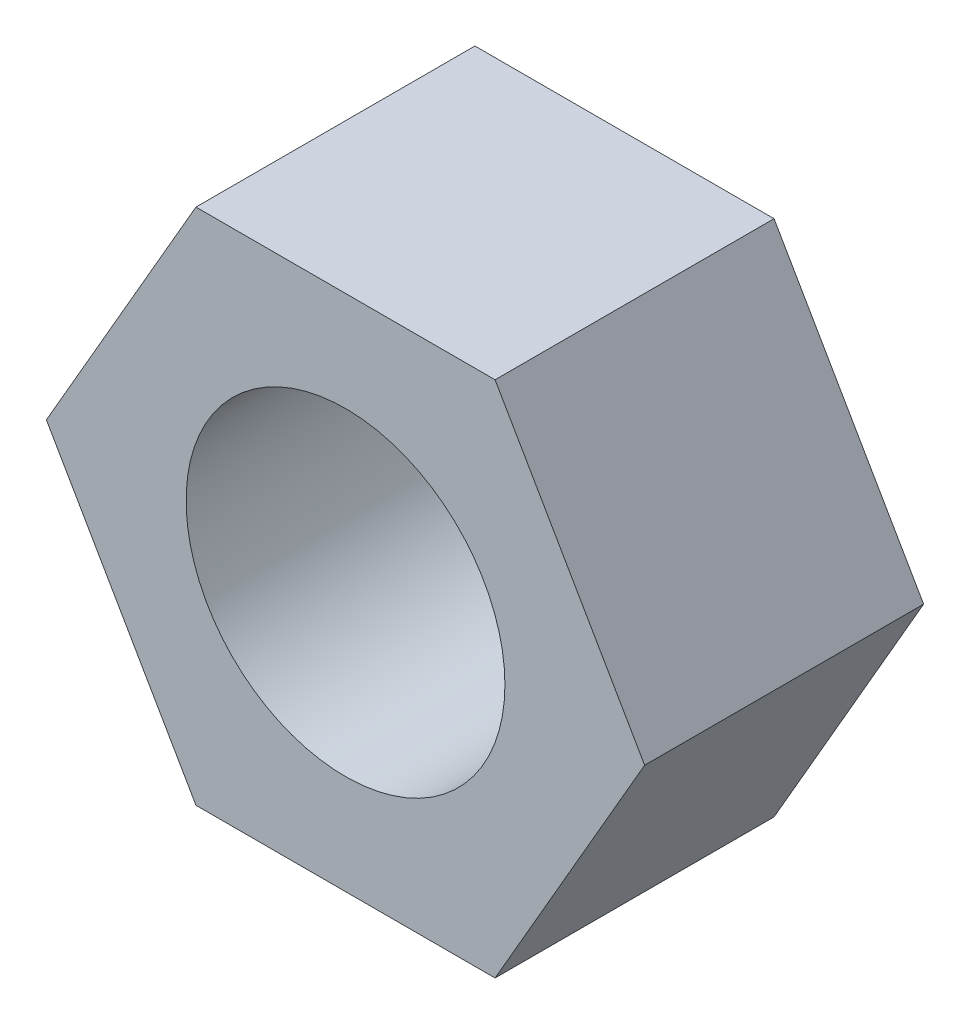
ISO-10303-21;
HEADER;
FILE_DESCRIPTION(('STEP AP214'),'2;1');
FILE_NAME('part.step','',(''),(''),'','','');
FILE_SCHEMA(('AUTOMOTIVE_DESIGN { 1 0 10303 214 1 1 1 1 }'));
ENDSEC;
DATA;
#1=APPLICATION_CONTEXT('core data for automotive mechanical design processes');
#2=APPLICATION_PROTOCOL_DEFINITION('international standard','automotive_design',2000,#1);
#3=PRODUCT_CONTEXT('',#1,'mechanical');
#4=PRODUCT('Part','Part','',(#3));
#5=PRODUCT_RELATED_PRODUCT_CATEGORY('part','',(#4));
#6=PRODUCT_DEFINITION_FORMATION('','',#4);
#7=PRODUCT_DEFINITION_CONTEXT('part definition',#1,'design');
#8=PRODUCT_DEFINITION('design','',#6,#7);
#9=PRODUCT_DEFINITION_SHAPE('','',#8);
#10=(LENGTH_UNIT() NAMED_UNIT(*) SI_UNIT(.MILLI.,.METRE.));
#11=(NAMED_UNIT(*) PLANE_ANGLE_UNIT() SI_UNIT($,.RADIAN.));
#12=(NAMED_UNIT(*) SI_UNIT($,.STERADIAN.) SOLID_ANGLE_UNIT());
#13=UNCERTAINTY_MEASURE_WITH_UNIT(LENGTH_MEASURE(1.E-05),#10,'distance_accuracy_value','');
#14=(GEOMETRIC_REPRESENTATION_CONTEXT(3) GLOBAL_UNCERTAINTY_ASSIGNED_CONTEXT((#13)) GLOBAL_UNIT_ASSIGNED_CONTEXT((#10,
#11,#12)) REPRESENTATION_CONTEXT('',''));
#15=CARTESIAN_POINT('',(0.,0.,0.));
#16=DIRECTION('',(0.,0.,1.));
#17=DIRECTION('',(1.,0.,0.));
#18=AXIS2_PLACEMENT_3D('',#15,#16,#17);
#19=CARTESIAN_POINT('',(3.75277674973263,-6.49999999999993,7.));
#20=DIRECTION('',(-0.866025403784442,0.499999999999995,0.));
#21=DIRECTION('',(-0.499999999999995,-0.866025403784442,0.));
#22=AXIS2_PLACEMENT_3D('',#19,#20,#21);
#23=PLANE('',#22);
#24=DIRECTION('',(0.499999999999995,0.866025403784442,0.));
#25=VECTOR('',#24,1.);
#26=CARTESIAN_POINT('',(3.75277674973263,-6.49999999999993,0.));
#27=LINE('',#26,#25);
#28=CARTESIAN_POINT('',(3.75277674973263,-6.49999999999993,0.));
#29=VERTEX_POINT('',#28);
#30=CARTESIAN_POINT('',(7.50555349946511,0.,0.));
#31=VERTEX_POINT('',#30);
#32=EDGE_CURVE('E123',#29,#31,#27,.T.);
#33=ORIENTED_EDGE('',*,*,#32,.T.);
#34=DIRECTION('',(0.,0.,-1.));
#35=VECTOR('',#34,1.);
#36=CARTESIAN_POINT('',(7.50555349946511,0.,7.));
#37=LINE('',#36,#35);
#38=CARTESIAN_POINT('',(7.50555349946511,0.,7.));
#39=VERTEX_POINT('',#38);
#40=EDGE_CURVE('E11',#39,#31,#37,.T.);
#41=ORIENTED_EDGE('',*,*,#40,.F.);
#42=DIRECTION('',(0.499999999999995,0.866025403784442,0.));
#43=VECTOR('',#42,1.);
#44=CARTESIAN_POINT('',(3.75277674973263,-6.49999999999993,7.));
#45=LINE('',#44,#43);
#46=CARTESIAN_POINT('',(3.75277674973263,-6.49999999999993,7.));
#47=VERTEX_POINT('',#46);
#48=EDGE_CURVE('E134',#47,#39,#45,.T.);
#49=ORIENTED_EDGE('',*,*,#48,.F.);
#50=DIRECTION('',(0.,0.,-1.));
#51=VECTOR('',#50,1.);
#52=CARTESIAN_POINT('',(3.75277674973263,-6.49999999999993,7.));
#53=LINE('',#52,#51);
#54=EDGE_CURVE('E119',#47,#29,#53,.T.);
#55=ORIENTED_EDGE('',*,*,#54,.T.);
#56=EDGE_LOOP('',(#33,#41,#49,#55));
#57=FACE_BOUND('',#56,.T.);
#58=ADVANCED_FACE('F39',(#57),#23,.F.);
#59=CARTESIAN_POINT('',(7.50555349946511,0.,7.));
#60=DIRECTION('',(-0.866025403784438,-0.500000000000001,0.));
#61=DIRECTION('',(0.500000000000001,-0.866025403784438,0.));
#62=AXIS2_PLACEMENT_3D('',#59,#60,#61);
#63=PLANE('',#62);
#64=DIRECTION('',(-0.500000000000001,0.866025403784438,0.));
#65=VECTOR('',#64,1.);
#66=CARTESIAN_POINT('',(7.50555349946511,0.,0.));
#67=LINE('',#66,#65);
#68=CARTESIAN_POINT('',(3.75277674973254,6.49999999999999,0.));
#69=VERTEX_POINT('',#68);
#70=EDGE_CURVE('E126',#31,#69,#67,.T.);
#71=ORIENTED_EDGE('',*,*,#70,.T.);
#72=DIRECTION('',(0.,0.,-1.));
#73=VECTOR('',#72,1.);
#74=CARTESIAN_POINT('',(3.75277674973254,6.49999999999999,7.));
#75=LINE('',#74,#73);
#76=CARTESIAN_POINT('',(3.75277674973254,6.49999999999999,7.));
#77=VERTEX_POINT('',#76);
#78=EDGE_CURVE('E47',#77,#69,#75,.T.);
#79=ORIENTED_EDGE('',*,*,#78,.F.);
#80=DIRECTION('',(-0.500000000000001,0.866025403784438,0.));
#81=VECTOR('',#80,1.);
#82=CARTESIAN_POINT('',(7.50555349946511,0.,7.));
#83=LINE('',#82,#81);
#84=EDGE_CURVE('E92',#39,#77,#83,.T.);
#85=ORIENTED_EDGE('',*,*,#84,.F.);
#86=ORIENTED_EDGE('',*,*,#40,.T.);
#87=EDGE_LOOP('',(#71,#79,#85,#86));
#88=FACE_BOUND('',#87,.T.);
#89=ADVANCED_FACE('F159',(#88),#63,.F.);
#90=CARTESIAN_POINT('',(3.75277674973254,6.49999999999999,7.));
#91=DIRECTION('',(0.,-1.,0.));
#92=DIRECTION('',(1.,0.,0.));
#93=AXIS2_PLACEMENT_3D('',#90,#91,#92);
#94=PLANE('',#93);
#95=DIRECTION('',(-1.,0.,0.));
#96=VECTOR('',#95,1.);
#97=CARTESIAN_POINT('',(3.75277674973254,6.49999999999999,0.));
#98=LINE('',#97,#96);
#99=CARTESIAN_POINT('',(-3.75277674973258,6.49999999999996,0.));
#100=VERTEX_POINT('',#99);
#101=EDGE_CURVE('E129',#69,#100,#98,.T.);
#102=ORIENTED_EDGE('',*,*,#101,.T.);
#103=DIRECTION('',(0.,0.,-1.));
#104=VECTOR('',#103,1.);
#105=CARTESIAN_POINT('',(-3.75277674973258,6.49999999999996,7.));
#106=LINE('',#105,#104);
#107=CARTESIAN_POINT('',(-3.75277674973258,6.49999999999996,7.));
#108=VERTEX_POINT('',#107);
#109=EDGE_CURVE('E114',#108,#100,#106,.T.);
#110=ORIENTED_EDGE('',*,*,#109,.F.);
#111=DIRECTION('',(-1.,0.,0.));
#112=VECTOR('',#111,1.);
#113=CARTESIAN_POINT('',(3.75277674973254,6.49999999999999,7.));
#114=LINE('',#113,#112);
#115=EDGE_CURVE('E105',#77,#108,#114,.T.);
#116=ORIENTED_EDGE('',*,*,#115,.F.);
#117=ORIENTED_EDGE('',*,*,#78,.T.);
#118=EDGE_LOOP('',(#102,#110,#116,#117));
#119=FACE_BOUND('',#118,.T.);
#120=ADVANCED_FACE('F140',(#119),#94,.F.);
#121=CARTESIAN_POINT('',(-3.75277674973258,6.49999999999996,7.));
#122=DIRECTION('',(0.866025403784441,-0.499999999999995,0.));
#123=DIRECTION('',(0.499999999999995,0.866025403784442,0.));
#124=AXIS2_PLACEMENT_3D('',#121,#122,#123);
#125=PLANE('',#124);
#126=DIRECTION('',(-0.499999999999995,-0.866025403784441,0.));
#127=VECTOR('',#126,1.);
#128=CARTESIAN_POINT('',(-3.75277674973258,6.49999999999996,0.));
#129=LINE('',#128,#127);
#130=CARTESIAN_POINT('',(-7.50555349946511,0.,0.));
#131=VERTEX_POINT('',#130);
#132=EDGE_CURVE('E113',#100,#131,#129,.T.);
#133=ORIENTED_EDGE('',*,*,#132,.T.);
#134=DIRECTION('',(0.,0.,-1.));
#135=VECTOR('',#134,1.);
#136=CARTESIAN_POINT('',(-7.50555349946511,0.,7.));
#137=LINE('',#136,#135);
#138=CARTESIAN_POINT('',(-7.50555349946511,0.,7.));
#139=VERTEX_POINT('',#138);
#140=EDGE_CURVE('E110',#139,#131,#137,.T.);
#141=ORIENTED_EDGE('',*,*,#140,.F.);
#142=DIRECTION('',(-0.499999999999995,-0.866025403784441,0.));
#143=VECTOR('',#142,1.);
#144=CARTESIAN_POINT('',(-3.75277674973258,6.49999999999996,7.));
#145=LINE('',#144,#143);
#146=EDGE_CURVE('E99',#108,#139,#145,.T.);
#147=ORIENTED_EDGE('',*,*,#146,.F.);
#148=ORIENTED_EDGE('',*,*,#109,.T.);
#149=EDGE_LOOP('',(#133,#141,#147,#148));
#150=FACE_BOUND('',#149,.T.);
#151=ADVANCED_FACE('F111',(#150),#125,.F.);
#152=CARTESIAN_POINT('',(-7.50555349946511,0.,7.));
#153=DIRECTION('',(0.866025403784435,0.500000000000007,0.));
#154=DIRECTION('',(-0.500000000000007,0.866025403784435,0.));
#155=AXIS2_PLACEMENT_3D('',#152,#153,#154);
#156=PLANE('',#155);
#157=DIRECTION('',(0.500000000000007,-0.866025403784435,0.));
#158=VECTOR('',#157,1.);
#159=CARTESIAN_POINT('',(-7.50555349946511,0.,0.));
#160=LINE('',#159,#158);
#161=CARTESIAN_POINT('',(-3.75277674973249,-6.50000000000001,0.));
#162=VERTEX_POINT('',#161);
#163=EDGE_CURVE('E78',#131,#162,#160,.T.);
#164=ORIENTED_EDGE('',*,*,#163,.T.);
#165=DIRECTION('',(0.,0.,-1.));
#166=VECTOR('',#165,1.);
#167=CARTESIAN_POINT('',(-3.75277674973249,-6.50000000000001,7.));
#168=LINE('',#167,#166);
#169=CARTESIAN_POINT('',(-3.75277674973249,-6.50000000000001,7.));
#170=VERTEX_POINT('',#169);
#171=EDGE_CURVE('E115',#170,#162,#168,.T.);
#172=ORIENTED_EDGE('',*,*,#171,.F.);
#173=DIRECTION('',(0.500000000000007,-0.866025403784435,0.));
#174=VECTOR('',#173,1.);
#175=CARTESIAN_POINT('',(-7.50555349946511,0.,7.));
#176=LINE('',#175,#174);
#177=EDGE_CURVE('E103',#139,#170,#176,.T.);
#178=ORIENTED_EDGE('',*,*,#177,.F.);
#179=ORIENTED_EDGE('',*,*,#140,.T.);
#180=EDGE_LOOP('',(#164,#172,#178,#179));
#181=FACE_BOUND('',#180,.T.);
#182=ADVANCED_FACE('F117',(#181),#156,.F.);
#183=CARTESIAN_POINT('',(-3.75277674973249,-6.50000000000001,7.));
#184=DIRECTION('',(0.,1.,0.));
#185=DIRECTION('',(-1.,0.,0.));
#186=AXIS2_PLACEMENT_3D('',#183,#184,#185);
#187=PLANE('',#186);
#188=DIRECTION('',(1.,0.,0.));
#189=VECTOR('',#188,1.);
#190=CARTESIAN_POINT('',(-3.75277674973249,-6.50000000000001,0.));
#191=LINE('',#190,#189);
#192=EDGE_CURVE('E84',#162,#29,#191,.T.);
#193=ORIENTED_EDGE('',*,*,#192,.T.);
#194=ORIENTED_EDGE('',*,*,#54,.F.);
#195=DIRECTION('',(1.,0.,0.));
#196=VECTOR('',#195,1.);
#197=CARTESIAN_POINT('',(-3.75277674973249,-6.50000000000001,7.));
#198=LINE('',#197,#196);
#199=EDGE_CURVE('E55',#170,#47,#198,.T.);
#200=ORIENTED_EDGE('',*,*,#199,.F.);
#201=ORIENTED_EDGE('',*,*,#171,.T.);
#202=EDGE_LOOP('',(#193,#194,#200,#201));
#203=FACE_BOUND('',#202,.T.);
#204=ADVANCED_FACE('F147',(#203),#187,.F.);
#205=CARTESIAN_POINT('',(0.,0.,7.));
#206=DIRECTION('',(0.,0.,1.));
#207=DIRECTION('',(1.,0.,0.));
#208=AXIS2_PLACEMENT_3D('',#205,#206,#207);
#209=PLANE('',#208);
#210=CARTESIAN_POINT('',(0.,0.,7.));
#211=DIRECTION('',(0.,0.,1.));
#212=DIRECTION('',(1.,0.,0.));
#213=AXIS2_PLACEMENT_3D('',#210,#211,#212);
#214=CIRCLE('',#213,4.);
#215=CARTESIAN_POINT('',(4.,0.,7.));
#216=VERTEX_POINT('',#215);
#217=EDGE_CURVE('E214',#216,#216,#214,.T.);
#218=ORIENTED_EDGE('',*,*,#217,.F.);
#219=EDGE_LOOP('',(#218));
#220=FACE_BOUND('',#219,.T.);
#221=ORIENTED_EDGE('',*,*,#48,.T.);
#222=ORIENTED_EDGE('',*,*,#84,.T.);
#223=ORIENTED_EDGE('',*,*,#115,.T.);
#224=ORIENTED_EDGE('',*,*,#146,.T.);
#225=ORIENTED_EDGE('',*,*,#177,.T.);
#226=ORIENTED_EDGE('',*,*,#199,.T.);
#227=EDGE_LOOP('',(#221,#222,#223,#224,#225,#226));
#228=FACE_BOUND('',#227,.T.);
#229=ADVANCED_FACE('F101',(#220,#228),#209,.T.);
#230=CARTESIAN_POINT('',(0.,0.,0.));
#231=DIRECTION('',(0.,0.,1.));
#232=DIRECTION('',(1.,0.,0.));
#233=AXIS2_PLACEMENT_3D('',#230,#231,#232);
#234=PLANE('',#233);
#235=CARTESIAN_POINT('',(0.,0.,0.));
#236=DIRECTION('',(0.,0.,1.));
#237=DIRECTION('',(1.,0.,0.));
#238=AXIS2_PLACEMENT_3D('',#235,#236,#237);
#239=CIRCLE('',#238,4.);
#240=CARTESIAN_POINT('',(4.,0.,0.));
#241=VERTEX_POINT('',#240);
#242=EDGE_CURVE('E127',#241,#241,#239,.T.);
#243=ORIENTED_EDGE('',*,*,#242,.T.);
#244=EDGE_LOOP('',(#243));
#245=FACE_BOUND('',#244,.T.);
#246=ORIENTED_EDGE('',*,*,#32,.F.);
#247=ORIENTED_EDGE('',*,*,#192,.F.);
#248=ORIENTED_EDGE('',*,*,#163,.F.);
#249=ORIENTED_EDGE('',*,*,#132,.F.);
#250=ORIENTED_EDGE('',*,*,#101,.F.);
#251=ORIENTED_EDGE('',*,*,#70,.F.);
#252=EDGE_LOOP('',(#246,#247,#248,#249,#250,#251));
#253=FACE_BOUND('',#252,.T.);
#254=ADVANCED_FACE('F143',(#245,#253),#234,.F.);
#255=CARTESIAN_POINT('',(0.,0.,0.));
#256=DIRECTION('',(0.,0.,1.));
#257=DIRECTION('',(1.,0.,0.));
#258=AXIS2_PLACEMENT_3D('',#255,#256,#257);
#259=CYLINDRICAL_SURFACE('',#258,4.);
#260=ORIENTED_EDGE('',*,*,#242,.F.);
#261=EDGE_LOOP('',(#260));
#262=FACE_BOUND('',#261,.T.);
#263=ORIENTED_EDGE('',*,*,#217,.T.);
#264=EDGE_LOOP('',(#263));
#265=FACE_BOUND('',#264,.T.);
#266=ADVANCED_FACE('F196',(#262,#265),#259,.F.);
#267=CLOSED_SHELL('',(#58,#89,#120,#151,#182,#204,#229,#254,#266));
#268=MANIFOLD_SOLID_BREP('B2',#267);
#269=ADVANCED_BREP_SHAPE_REPRESENTATION('',(#18,#268),#14);
#270=SHAPE_DEFINITION_REPRESENTATION(#9,#269);
ENDSEC;
END-ISO-10303-21;
